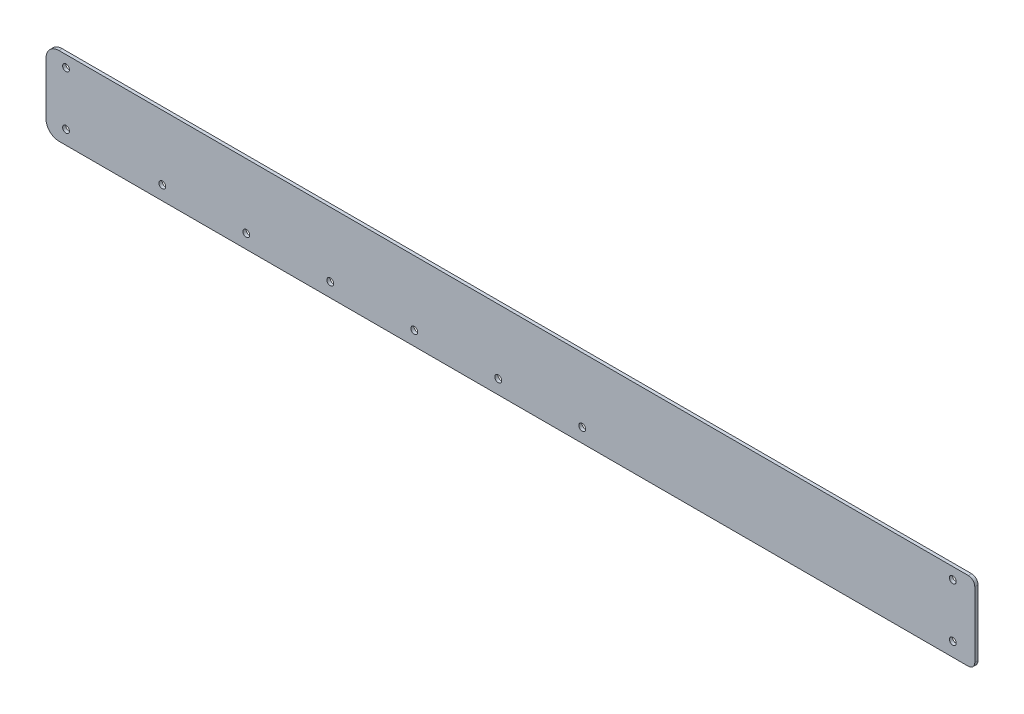
ISO-10303-21;
HEADER;
FILE_DESCRIPTION(('STEP AP214'),'2;1');
FILE_NAME('part.step','',(''),(''),'','','');
FILE_SCHEMA(('AUTOMOTIVE_DESIGN { 1 0 10303 214 1 1 1 1 }'));
ENDSEC;
DATA;
#1=APPLICATION_CONTEXT('core data for automotive mechanical design processes');
#2=APPLICATION_PROTOCOL_DEFINITION('international standard','automotive_design',2000,#1);
#3=PRODUCT_CONTEXT('',#1,'mechanical');
#4=PRODUCT('Part','Part','',(#3));
#5=PRODUCT_RELATED_PRODUCT_CATEGORY('part','',(#4));
#6=PRODUCT_DEFINITION_FORMATION('','',#4);
#7=PRODUCT_DEFINITION_CONTEXT('part definition',#1,'design');
#8=PRODUCT_DEFINITION('design','',#6,#7);
#9=PRODUCT_DEFINITION_SHAPE('','',#8);
#10=(LENGTH_UNIT() NAMED_UNIT(*) SI_UNIT(.MILLI.,.METRE.));
#11=(NAMED_UNIT(*) PLANE_ANGLE_UNIT() SI_UNIT($,.RADIAN.));
#12=(NAMED_UNIT(*) SI_UNIT($,.STERADIAN.) SOLID_ANGLE_UNIT());
#13=UNCERTAINTY_MEASURE_WITH_UNIT(LENGTH_MEASURE(1.E-05),#10,'distance_accuracy_value','');
#14=(GEOMETRIC_REPRESENTATION_CONTEXT(3) GLOBAL_UNCERTAINTY_ASSIGNED_CONTEXT((#13)) GLOBAL_UNIT_ASSIGNED_CONTEXT((#10,
#11,#12)) REPRESENTATION_CONTEXT('',''));
#15=CARTESIAN_POINT('',(0.,0.,0.));
#16=DIRECTION('',(0.,0.,1.));
#17=DIRECTION('',(1.,0.,0.));
#18=AXIS2_PLACEMENT_3D('',#15,#16,#17);
#19=CARTESIAN_POINT('',(370.889379555431,207.968513878229,2.));
#20=DIRECTION('',(0.,0.,1.));
#21=DIRECTION('',(1.,0.,0.));
#22=AXIS2_PLACEMENT_3D('',#19,#20,#21);
#23=PLANE('',#22);
#24=CARTESIAN_POINT('',(361.28937955542,171.922740720662,2.));
#25=DIRECTION('',(0.,0.,1.));
#26=DIRECTION('',(1.,0.,0.));
#27=AXIS2_PLACEMENT_3D('',#24,#25,#26);
#28=CIRCLE('',#27,2.09999999999999);
#29=CARTESIAN_POINT('',(363.38937955542,171.922740720662,2.));
#30=VERTEX_POINT('',#29);
#31=EDGE_CURVE('E224',#30,#30,#28,.T.);
#32=ORIENTED_EDGE('',*,*,#31,.F.);
#33=EDGE_LOOP('',(#32));
#34=FACE_BOUND('',#33,.T.);
#35=CARTESIAN_POINT('',(79.8631122909393,171.922740720662,2.));
#36=DIRECTION('',(0.,0.,1.));
#37=DIRECTION('',(1.,0.,0.));
#38=AXIS2_PLACEMENT_3D('',#35,#36,#37);
#39=CIRCLE('',#38,2.1);
#40=CARTESIAN_POINT('',(81.9631122909393,171.922740720662,2.));
#41=VERTEX_POINT('',#40);
#42=EDGE_CURVE('E212',#41,#41,#39,.T.);
#43=ORIENTED_EDGE('',*,*,#42,.F.);
#44=EDGE_LOOP('',(#43));
#45=FACE_BOUND('',#44,.T.);
#46=CARTESIAN_POINT('',(-128.136887709061,171.922740720662,2.));
#47=DIRECTION('',(0.,0.,1.));
#48=DIRECTION('',(1.,0.,0.));
#49=AXIS2_PLACEMENT_3D('',#46,#47,#48);
#50=CIRCLE('',#49,2.09999999999999);
#51=CARTESIAN_POINT('',(-126.036887709061,171.922740720662,2.));
#52=VERTEX_POINT('',#51);
#53=EDGE_CURVE('E200',#52,#52,#50,.T.);
#54=ORIENTED_EDGE('',*,*,#53,.F.);
#55=EDGE_LOOP('',(#54));
#56=FACE_BOUND('',#55,.T.);
#57=CARTESIAN_POINT('',(-76.1368877090607,171.922740720662,2.));
#58=DIRECTION('',(0.,0.,1.));
#59=DIRECTION('',(1.,0.,0.));
#60=AXIS2_PLACEMENT_3D('',#57,#58,#59);
#61=CIRCLE('',#60,2.1);
#62=CARTESIAN_POINT('',(-74.0368877090607,171.922740720662,2.));
#63=VERTEX_POINT('',#62);
#64=EDGE_CURVE('E188',#63,#63,#61,.T.);
#65=ORIENTED_EDGE('',*,*,#64,.F.);
#66=EDGE_LOOP('',(#65));
#67=FACE_BOUND('',#66,.T.);
#68=CARTESIAN_POINT('',(361.28937955542,204.922740720662,2.));
#69=DIRECTION('',(0.,0.,1.));
#70=DIRECTION('',(1.,0.,0.));
#71=AXIS2_PLACEMENT_3D('',#68,#69,#70);
#72=CIRCLE('',#71,2.09999999999999);
#73=CARTESIAN_POINT('',(363.38937955542,204.922740720662,2.));
#74=VERTEX_POINT('',#73);
#75=EDGE_CURVE('E134',#74,#74,#72,.T.);
#76=ORIENTED_EDGE('',*,*,#75,.F.);
#77=EDGE_LOOP('',(#76));
#78=FACE_BOUND('',#77,.T.);
#79=CARTESIAN_POINT('',(370.889379555431,207.968513878229,2.));
#80=DIRECTION('',(0.,0.,1.));
#81=DIRECTION('',(1.,0.,0.));
#82=AXIS2_PLACEMENT_3D('',#79,#80,#81);
#83=CIRCLE('',#82,4.);
#84=CARTESIAN_POINT('',(374.889379555431,207.968513878229,2.));
#85=VERTEX_POINT('',#84);
#86=CARTESIAN_POINT('',(370.889379555431,211.968513878229,2.));
#87=VERTEX_POINT('',#86);
#88=EDGE_CURVE('E145',#85,#87,#83,.T.);
#89=ORIENTED_EDGE('',*,*,#88,.T.);
#90=DIRECTION('',(-1.,0.,0.));
#91=VECTOR('',#90,1.);
#92=CARTESIAN_POINT('',(370.889379555431,211.968513878229,2.));
#93=LINE('',#92,#91);
#94=CARTESIAN_POINT('',(-192.127528461996,211.968513878229,2.));
#95=VERTEX_POINT('',#94);
#96=EDGE_CURVE('E93',#87,#95,#93,.T.);
#97=ORIENTED_EDGE('',*,*,#96,.T.);
#98=CARTESIAN_POINT('',(-192.127528461996,203.968513878229,2.));
#99=DIRECTION('',(0.,0.,1.));
#100=DIRECTION('',(1.,0.,0.));
#101=AXIS2_PLACEMENT_3D('',#98,#99,#100);
#102=CIRCLE('',#101,8.00000000000002);
#103=CARTESIAN_POINT('',(-200.127528461996,203.968513878229,2.));
#104=VERTEX_POINT('',#103);
#105=EDGE_CURVE('E160',#95,#104,#102,.T.);
#106=ORIENTED_EDGE('',*,*,#105,.T.);
#107=DIRECTION('',(0.,-1.,0.));
#108=VECTOR('',#107,1.);
#109=CARTESIAN_POINT('',(-200.127528461996,171.305548091745,2.));
#110=LINE('',#109,#108);
#111=CARTESIAN_POINT('',(-200.127528461996,171.305548091745,2.));
#112=VERTEX_POINT('',#111);
#113=EDGE_CURVE('E173',#104,#112,#110,.T.);
#114=ORIENTED_EDGE('',*,*,#113,.T.);
#115=CARTESIAN_POINT('',(-192.127528461996,171.305548091745,2.));
#116=DIRECTION('',(0.,0.,1.));
#117=DIRECTION('',(1.,0.,0.));
#118=AXIS2_PLACEMENT_3D('',#115,#116,#117);
#119=CIRCLE('',#118,8.00000000000001);
#120=CARTESIAN_POINT('',(-192.127528461996,163.305548091745,2.));
#121=VERTEX_POINT('',#120);
#122=EDGE_CURVE('E112',#112,#121,#119,.T.);
#123=ORIENTED_EDGE('',*,*,#122,.T.);
#124=DIRECTION('',(1.,0.,0.));
#125=VECTOR('',#124,1.);
#126=CARTESIAN_POINT('',(-192.127528461996,163.305548091745,2.));
#127=LINE('',#126,#125);
#128=CARTESIAN_POINT('',(370.889379555431,163.305548091745,2.));
#129=VERTEX_POINT('',#128);
#130=EDGE_CURVE('E106',#121,#129,#127,.T.);
#131=ORIENTED_EDGE('',*,*,#130,.T.);
#132=CARTESIAN_POINT('',(370.889379555431,167.305548091745,2.));
#133=DIRECTION('',(0.,0.,1.));
#134=DIRECTION('',(1.,0.,0.));
#135=AXIS2_PLACEMENT_3D('',#132,#133,#134);
#136=CIRCLE('',#135,4.);
#137=CARTESIAN_POINT('',(374.889379555431,167.305548091745,2.));
#138=VERTEX_POINT('',#137);
#139=EDGE_CURVE('E110',#129,#138,#136,.T.);
#140=ORIENTED_EDGE('',*,*,#139,.T.);
#141=DIRECTION('',(0.,1.,0.));
#142=VECTOR('',#141,1.);
#143=CARTESIAN_POINT('',(374.889379555431,207.968513878229,2.));
#144=LINE('',#143,#142);
#145=EDGE_CURVE('E50',#138,#85,#144,.T.);
#146=ORIENTED_EDGE('',*,*,#145,.T.);
#147=EDGE_LOOP('',(#89,#97,#106,#114,#123,#131,#140,#146));
#148=FACE_BOUND('',#147,.T.);
#149=CARTESIAN_POINT('',(-187.724187676641,204.922740720662,2.));
#150=DIRECTION('',(0.,0.,1.));
#151=DIRECTION('',(1.,0.,0.));
#152=AXIS2_PLACEMENT_3D('',#149,#150,#151);
#153=CIRCLE('',#152,2.09999999999999);
#154=CARTESIAN_POINT('',(-185.624187676641,204.922740720662,2.));
#155=VERTEX_POINT('',#154);
#156=EDGE_CURVE('E182',#155,#155,#153,.T.);
#157=ORIENTED_EDGE('',*,*,#156,.F.);
#158=EDGE_LOOP('',(#157));
#159=FACE_BOUND('',#158,.T.);
#160=CARTESIAN_POINT('',(-24.1368877090607,171.922740720662,2.));
#161=DIRECTION('',(0.,0.,1.));
#162=DIRECTION('',(1.,0.,0.));
#163=AXIS2_PLACEMENT_3D('',#160,#161,#162);
#164=CIRCLE('',#163,2.1);
#165=CARTESIAN_POINT('',(-22.0368877090607,171.922740720662,2.));
#166=VERTEX_POINT('',#165);
#167=EDGE_CURVE('E194',#166,#166,#164,.T.);
#168=ORIENTED_EDGE('',*,*,#167,.F.);
#169=EDGE_LOOP('',(#168));
#170=FACE_BOUND('',#169,.T.);
#171=CARTESIAN_POINT('',(131.863112290939,171.922740720662,2.));
#172=DIRECTION('',(0.,0.,1.));
#173=DIRECTION('',(1.,0.,0.));
#174=AXIS2_PLACEMENT_3D('',#171,#172,#173);
#175=CIRCLE('',#174,2.09999999999999);
#176=CARTESIAN_POINT('',(133.963112290939,171.922740720662,2.));
#177=VERTEX_POINT('',#176);
#178=EDGE_CURVE('E206',#177,#177,#175,.T.);
#179=ORIENTED_EDGE('',*,*,#178,.F.);
#180=EDGE_LOOP('',(#179));
#181=FACE_BOUND('',#180,.T.);
#182=CARTESIAN_POINT('',(27.8631122909393,171.922740720662,2.));
#183=DIRECTION('',(0.,0.,1.));
#184=DIRECTION('',(1.,0.,0.));
#185=AXIS2_PLACEMENT_3D('',#182,#183,#184);
#186=CIRCLE('',#185,2.1);
#187=CARTESIAN_POINT('',(29.9631122909393,171.922740720662,2.));
#188=VERTEX_POINT('',#187);
#189=EDGE_CURVE('E218',#188,#188,#186,.T.);
#190=ORIENTED_EDGE('',*,*,#189,.F.);
#191=EDGE_LOOP('',(#190));
#192=FACE_BOUND('',#191,.T.);
#193=CARTESIAN_POINT('',(-187.724187676641,171.922740720662,2.));
#194=DIRECTION('',(0.,0.,1.));
#195=DIRECTION('',(1.,0.,0.));
#196=AXIS2_PLACEMENT_3D('',#193,#194,#195);
#197=CIRCLE('',#196,2.09999999999999);
#198=CARTESIAN_POINT('',(-185.624187676641,171.922740720662,2.));
#199=VERTEX_POINT('',#198);
#200=EDGE_CURVE('E230',#199,#199,#197,.T.);
#201=ORIENTED_EDGE('',*,*,#200,.F.);
#202=EDGE_LOOP('',(#201));
#203=FACE_BOUND('',#202,.T.);
#204=ADVANCED_FACE('F33',(#34,#45,#56,#67,#78,#148,#159,#170,#181,#192,#203),#23,.T.);
#205=CARTESIAN_POINT('',(370.889379555431,207.968513878229,0.));
#206=DIRECTION('',(0.,0.,1.));
#207=DIRECTION('',(1.,0.,0.));
#208=AXIS2_PLACEMENT_3D('',#205,#206,#207);
#209=PLANE('',#208);
#210=CARTESIAN_POINT('',(370.889379555431,207.968513878229,0.));
#211=DIRECTION('',(0.,0.,1.));
#212=DIRECTION('',(1.,0.,0.));
#213=AXIS2_PLACEMENT_3D('',#210,#211,#212);
#214=CIRCLE('',#213,4.);
#215=CARTESIAN_POINT('',(374.889379555431,207.968513878229,0.));
#216=VERTEX_POINT('',#215);
#217=CARTESIAN_POINT('',(370.889379555431,211.968513878229,0.));
#218=VERTEX_POINT('',#217);
#219=EDGE_CURVE('E130',#216,#218,#214,.T.);
#220=ORIENTED_EDGE('',*,*,#219,.F.);
#221=DIRECTION('',(0.,1.,0.));
#222=VECTOR('',#221,1.);
#223=CARTESIAN_POINT('',(374.889379555431,207.968513878229,0.));
#224=LINE('',#223,#222);
#225=CARTESIAN_POINT('',(374.889379555431,167.305548091745,0.));
#226=VERTEX_POINT('',#225);
#227=EDGE_CURVE('E85',#226,#216,#224,.T.);
#228=ORIENTED_EDGE('',*,*,#227,.F.);
#229=CARTESIAN_POINT('',(370.889379555431,167.305548091745,0.));
#230=DIRECTION('',(0.,0.,1.));
#231=DIRECTION('',(1.,0.,0.));
#232=AXIS2_PLACEMENT_3D('',#229,#230,#231);
#233=CIRCLE('',#232,4.);
#234=CARTESIAN_POINT('',(370.889379555431,163.305548091745,0.));
#235=VERTEX_POINT('',#234);
#236=EDGE_CURVE('E79',#235,#226,#233,.T.);
#237=ORIENTED_EDGE('',*,*,#236,.F.);
#238=DIRECTION('',(1.,0.,0.));
#239=VECTOR('',#238,1.);
#240=CARTESIAN_POINT('',(-192.127528461996,163.305548091745,0.));
#241=LINE('',#240,#239);
#242=CARTESIAN_POINT('',(-192.127528461996,163.305548091745,0.));
#243=VERTEX_POINT('',#242);
#244=EDGE_CURVE('E120',#243,#235,#241,.T.);
#245=ORIENTED_EDGE('',*,*,#244,.F.);
#246=CARTESIAN_POINT('',(-192.127528461996,171.305548091745,0.));
#247=DIRECTION('',(0.,0.,1.));
#248=DIRECTION('',(1.,0.,0.));
#249=AXIS2_PLACEMENT_3D('',#246,#247,#248);
#250=CIRCLE('',#249,8.00000000000001);
#251=CARTESIAN_POINT('',(-200.127528461996,171.305548091745,0.));
#252=VERTEX_POINT('',#251);
#253=EDGE_CURVE('E140',#252,#243,#250,.T.);
#254=ORIENTED_EDGE('',*,*,#253,.F.);
#255=DIRECTION('',(0.,-1.,0.));
#256=VECTOR('',#255,1.);
#257=CARTESIAN_POINT('',(-200.127528461996,171.305548091745,0.));
#258=LINE('',#257,#256);
#259=CARTESIAN_POINT('',(-200.127528461996,203.968513878229,0.));
#260=VERTEX_POINT('',#259);
#261=EDGE_CURVE('E138',#260,#252,#258,.T.);
#262=ORIENTED_EDGE('',*,*,#261,.F.);
#263=CARTESIAN_POINT('',(-192.127528461996,203.968513878229,0.));
#264=DIRECTION('',(0.,0.,1.));
#265=DIRECTION('',(1.,0.,0.));
#266=AXIS2_PLACEMENT_3D('',#263,#264,#265);
#267=CIRCLE('',#266,8.00000000000002);
#268=CARTESIAN_POINT('',(-192.127528461996,211.968513878229,0.));
#269=VERTEX_POINT('',#268);
#270=EDGE_CURVE('E136',#269,#260,#267,.T.);
#271=ORIENTED_EDGE('',*,*,#270,.F.);
#272=DIRECTION('',(-1.,0.,0.));
#273=VECTOR('',#272,1.);
#274=CARTESIAN_POINT('',(370.889379555431,211.968513878229,0.));
#275=LINE('',#274,#273);
#276=EDGE_CURVE('E133',#218,#269,#275,.T.);
#277=ORIENTED_EDGE('',*,*,#276,.F.);
#278=EDGE_LOOP('',(#220,#228,#237,#245,#254,#262,#271,#277));
#279=FACE_BOUND('',#278,.T.);
#280=CARTESIAN_POINT('',(361.28937955542,204.922740720662,0.));
#281=DIRECTION('',(0.,0.,1.));
#282=DIRECTION('',(1.,0.,0.));
#283=AXIS2_PLACEMENT_3D('',#280,#281,#282);
#284=CIRCLE('',#283,2.09999999999999);
#285=CARTESIAN_POINT('',(363.38937955542,204.922740720662,0.));
#286=VERTEX_POINT('',#285);
#287=EDGE_CURVE('E179',#286,#286,#284,.T.);
#288=ORIENTED_EDGE('',*,*,#287,.T.);
#289=EDGE_LOOP('',(#288));
#290=FACE_BOUND('',#289,.T.);
#291=CARTESIAN_POINT('',(-187.724187676641,204.922740720662,0.));
#292=DIRECTION('',(0.,0.,1.));
#293=DIRECTION('',(1.,0.,0.));
#294=AXIS2_PLACEMENT_3D('',#291,#292,#293);
#295=CIRCLE('',#294,2.09999999999999);
#296=CARTESIAN_POINT('',(-185.624187676641,204.922740720662,0.));
#297=VERTEX_POINT('',#296);
#298=EDGE_CURVE('E185',#297,#297,#295,.T.);
#299=ORIENTED_EDGE('',*,*,#298,.T.);
#300=EDGE_LOOP('',(#299));
#301=FACE_BOUND('',#300,.T.);
#302=CARTESIAN_POINT('',(-76.1368877090607,171.922740720662,0.));
#303=DIRECTION('',(0.,0.,1.));
#304=DIRECTION('',(1.,0.,0.));
#305=AXIS2_PLACEMENT_3D('',#302,#303,#304);
#306=CIRCLE('',#305,2.1);
#307=CARTESIAN_POINT('',(-74.0368877090607,171.922740720662,0.));
#308=VERTEX_POINT('',#307);
#309=EDGE_CURVE('E191',#308,#308,#306,.T.);
#310=ORIENTED_EDGE('',*,*,#309,.T.);
#311=EDGE_LOOP('',(#310));
#312=FACE_BOUND('',#311,.T.);
#313=CARTESIAN_POINT('',(-24.1368877090607,171.922740720662,0.));
#314=DIRECTION('',(0.,0.,1.));
#315=DIRECTION('',(1.,0.,0.));
#316=AXIS2_PLACEMENT_3D('',#313,#314,#315);
#317=CIRCLE('',#316,2.1);
#318=CARTESIAN_POINT('',(-22.0368877090607,171.922740720662,0.));
#319=VERTEX_POINT('',#318);
#320=EDGE_CURVE('E197',#319,#319,#317,.T.);
#321=ORIENTED_EDGE('',*,*,#320,.T.);
#322=EDGE_LOOP('',(#321));
#323=FACE_BOUND('',#322,.T.);
#324=CARTESIAN_POINT('',(-128.136887709061,171.922740720662,0.));
#325=DIRECTION('',(0.,0.,1.));
#326=DIRECTION('',(1.,0.,0.));
#327=AXIS2_PLACEMENT_3D('',#324,#325,#326);
#328=CIRCLE('',#327,2.09999999999999);
#329=CARTESIAN_POINT('',(-126.036887709061,171.922740720662,0.));
#330=VERTEX_POINT('',#329);
#331=EDGE_CURVE('E203',#330,#330,#328,.T.);
#332=ORIENTED_EDGE('',*,*,#331,.T.);
#333=EDGE_LOOP('',(#332));
#334=FACE_BOUND('',#333,.T.);
#335=CARTESIAN_POINT('',(131.863112290939,171.922740720662,0.));
#336=DIRECTION('',(0.,0.,1.));
#337=DIRECTION('',(1.,0.,0.));
#338=AXIS2_PLACEMENT_3D('',#335,#336,#337);
#339=CIRCLE('',#338,2.09999999999999);
#340=CARTESIAN_POINT('',(133.963112290939,171.922740720662,0.));
#341=VERTEX_POINT('',#340);
#342=EDGE_CURVE('E209',#341,#341,#339,.T.);
#343=ORIENTED_EDGE('',*,*,#342,.T.);
#344=EDGE_LOOP('',(#343));
#345=FACE_BOUND('',#344,.T.);
#346=CARTESIAN_POINT('',(79.8631122909393,171.922740720662,0.));
#347=DIRECTION('',(0.,0.,1.));
#348=DIRECTION('',(1.,0.,0.));
#349=AXIS2_PLACEMENT_3D('',#346,#347,#348);
#350=CIRCLE('',#349,2.1);
#351=CARTESIAN_POINT('',(81.9631122909393,171.922740720662,0.));
#352=VERTEX_POINT('',#351);
#353=EDGE_CURVE('E215',#352,#352,#350,.T.);
#354=ORIENTED_EDGE('',*,*,#353,.T.);
#355=EDGE_LOOP('',(#354));
#356=FACE_BOUND('',#355,.T.);
#357=CARTESIAN_POINT('',(27.8631122909393,171.922740720662,0.));
#358=DIRECTION('',(0.,0.,1.));
#359=DIRECTION('',(1.,0.,0.));
#360=AXIS2_PLACEMENT_3D('',#357,#358,#359);
#361=CIRCLE('',#360,2.1);
#362=CARTESIAN_POINT('',(29.9631122909393,171.922740720662,0.));
#363=VERTEX_POINT('',#362);
#364=EDGE_CURVE('E221',#363,#363,#361,.T.);
#365=ORIENTED_EDGE('',*,*,#364,.T.);
#366=EDGE_LOOP('',(#365));
#367=FACE_BOUND('',#366,.T.);
#368=CARTESIAN_POINT('',(361.28937955542,171.922740720662,0.));
#369=DIRECTION('',(0.,0.,1.));
#370=DIRECTION('',(1.,0.,0.));
#371=AXIS2_PLACEMENT_3D('',#368,#369,#370);
#372=CIRCLE('',#371,2.09999999999999);
#373=CARTESIAN_POINT('',(363.38937955542,171.922740720662,0.));
#374=VERTEX_POINT('',#373);
#375=EDGE_CURVE('E227',#374,#374,#372,.T.);
#376=ORIENTED_EDGE('',*,*,#375,.T.);
#377=EDGE_LOOP('',(#376));
#378=FACE_BOUND('',#377,.T.);
#379=CARTESIAN_POINT('',(-187.724187676641,171.922740720662,0.));
#380=DIRECTION('',(0.,0.,1.));
#381=DIRECTION('',(1.,0.,0.));
#382=AXIS2_PLACEMENT_3D('',#379,#380,#381);
#383=CIRCLE('',#382,2.09999999999999);
#384=CARTESIAN_POINT('',(-185.624187676641,171.922740720662,0.));
#385=VERTEX_POINT('',#384);
#386=EDGE_CURVE('E233',#385,#385,#383,.T.);
#387=ORIENTED_EDGE('',*,*,#386,.T.);
#388=EDGE_LOOP('',(#387));
#389=FACE_BOUND('',#388,.T.);
#390=ADVANCED_FACE('F164',(#279,#290,#301,#312,#323,#334,#345,#356,#367,#378,#389),#209,.F.);
#391=CARTESIAN_POINT('',(370.889379555431,207.968513878229,2.));
#392=DIRECTION('',(0.,0.,-1.));
#393=DIRECTION('',(-1.,0.,0.));
#394=AXIS2_PLACEMENT_3D('',#391,#392,#393);
#395=CYLINDRICAL_SURFACE('',#394,4.);
#396=ORIENTED_EDGE('',*,*,#219,.T.);
#397=DIRECTION('',(0.,0.,-1.));
#398=VECTOR('',#397,1.);
#399=CARTESIAN_POINT('',(370.889379555431,211.968513878229,2.));
#400=LINE('',#399,#398);
#401=EDGE_CURVE('E11',#87,#218,#400,.T.);
#402=ORIENTED_EDGE('',*,*,#401,.F.);
#403=ORIENTED_EDGE('',*,*,#88,.F.);
#404=DIRECTION('',(0.,0.,-1.));
#405=VECTOR('',#404,1.);
#406=CARTESIAN_POINT('',(374.889379555431,207.968513878229,2.));
#407=LINE('',#406,#405);
#408=EDGE_CURVE('E126',#85,#216,#407,.T.);
#409=ORIENTED_EDGE('',*,*,#408,.T.);
#410=EDGE_LOOP('',(#396,#402,#403,#409));
#411=FACE_BOUND('',#410,.T.);
#412=ADVANCED_FACE('F35',(#411),#395,.T.);
#413=CARTESIAN_POINT('',(370.889379555431,211.968513878229,2.));
#414=DIRECTION('',(0.,-1.,0.));
#415=DIRECTION('',(1.,0.,0.));
#416=AXIS2_PLACEMENT_3D('',#413,#414,#415);
#417=PLANE('',#416);
#418=ORIENTED_EDGE('',*,*,#276,.T.);
#419=DIRECTION('',(0.,0.,-1.));
#420=VECTOR('',#419,1.);
#421=CARTESIAN_POINT('',(-192.127528461996,211.968513878229,2.));
#422=LINE('',#421,#420);
#423=EDGE_CURVE('E42',#95,#269,#422,.T.);
#424=ORIENTED_EDGE('',*,*,#423,.F.);
#425=ORIENTED_EDGE('',*,*,#96,.F.);
#426=ORIENTED_EDGE('',*,*,#401,.T.);
#427=EDGE_LOOP('',(#418,#424,#425,#426));
#428=FACE_BOUND('',#427,.T.);
#429=ADVANCED_FACE('F267',(#428),#417,.F.);
#430=CARTESIAN_POINT('',(-192.127528461996,203.968513878229,2.));
#431=DIRECTION('',(0.,0.,-1.));
#432=DIRECTION('',(-1.,0.,0.));
#433=AXIS2_PLACEMENT_3D('',#430,#431,#432);
#434=CYLINDRICAL_SURFACE('',#433,8.00000000000002);
#435=ORIENTED_EDGE('',*,*,#270,.T.);
#436=DIRECTION('',(0.,0.,-1.));
#437=VECTOR('',#436,1.);
#438=CARTESIAN_POINT('',(-200.127528461996,203.968513878229,2.));
#439=LINE('',#438,#437);
#440=EDGE_CURVE('E152',#104,#260,#439,.T.);
#441=ORIENTED_EDGE('',*,*,#440,.F.);
#442=ORIENTED_EDGE('',*,*,#105,.F.);
#443=ORIENTED_EDGE('',*,*,#423,.T.);
#444=EDGE_LOOP('',(#435,#441,#442,#443));
#445=FACE_BOUND('',#444,.T.);
#446=ADVANCED_FACE('F158',(#445),#434,.T.);
#447=CARTESIAN_POINT('',(-200.127528461996,171.305548091745,2.));
#448=DIRECTION('',(1.,0.,0.));
#449=DIRECTION('',(0.,0.,-1.));
#450=AXIS2_PLACEMENT_3D('',#447,#448,#449);
#451=PLANE('',#450);
#452=ORIENTED_EDGE('',*,*,#261,.T.);
#453=DIRECTION('',(0.,0.,-1.));
#454=VECTOR('',#453,1.);
#455=CARTESIAN_POINT('',(-200.127528461996,171.305548091745,2.));
#456=LINE('',#455,#454);
#457=EDGE_CURVE('E149',#112,#252,#456,.T.);
#458=ORIENTED_EDGE('',*,*,#457,.F.);
#459=ORIENTED_EDGE('',*,*,#113,.F.);
#460=ORIENTED_EDGE('',*,*,#440,.T.);
#461=EDGE_LOOP('',(#452,#458,#459,#460));
#462=FACE_BOUND('',#461,.T.);
#463=ADVANCED_FACE('F169',(#462),#451,.F.);
#464=CARTESIAN_POINT('',(-192.127528461996,171.305548091745,2.));
#465=DIRECTION('',(0.,0.,-1.));
#466=DIRECTION('',(-1.,0.,0.));
#467=AXIS2_PLACEMENT_3D('',#464,#465,#466);
#468=CYLINDRICAL_SURFACE('',#467,8.00000000000001);
#469=ORIENTED_EDGE('',*,*,#253,.T.);
#470=DIRECTION('',(0.,0.,-1.));
#471=VECTOR('',#470,1.);
#472=CARTESIAN_POINT('',(-192.127528461996,163.305548091745,2.));
#473=LINE('',#472,#471);
#474=EDGE_CURVE('E121',#121,#243,#473,.T.);
#475=ORIENTED_EDGE('',*,*,#474,.F.);
#476=ORIENTED_EDGE('',*,*,#122,.F.);
#477=ORIENTED_EDGE('',*,*,#457,.T.);
#478=EDGE_LOOP('',(#469,#475,#476,#477));
#479=FACE_BOUND('',#478,.T.);
#480=ADVANCED_FACE('F172',(#479),#468,.T.);
#481=CARTESIAN_POINT('',(-192.127528461996,163.305548091745,2.));
#482=DIRECTION('',(0.,1.,0.));
#483=DIRECTION('',(-1.,0.,0.));
#484=AXIS2_PLACEMENT_3D('',#481,#482,#483);
#485=PLANE('',#484);
#486=ORIENTED_EDGE('',*,*,#244,.T.);
#487=DIRECTION('',(0.,0.,-1.));
#488=VECTOR('',#487,1.);
#489=CARTESIAN_POINT('',(370.889379555431,163.305548091745,2.));
#490=LINE('',#489,#488);
#491=EDGE_CURVE('E117',#129,#235,#490,.T.);
#492=ORIENTED_EDGE('',*,*,#491,.F.);
#493=ORIENTED_EDGE('',*,*,#130,.F.);
#494=ORIENTED_EDGE('',*,*,#474,.T.);
#495=EDGE_LOOP('',(#486,#492,#493,#494));
#496=FACE_BOUND('',#495,.T.);
#497=ADVANCED_FACE('F118',(#496),#485,.F.);
#498=CARTESIAN_POINT('',(370.889379555431,167.305548091745,2.));
#499=DIRECTION('',(0.,0.,-1.));
#500=DIRECTION('',(-1.,0.,0.));
#501=AXIS2_PLACEMENT_3D('',#498,#499,#500);
#502=CYLINDRICAL_SURFACE('',#501,4.);
#503=ORIENTED_EDGE('',*,*,#236,.T.);
#504=DIRECTION('',(0.,0.,-1.));
#505=VECTOR('',#504,1.);
#506=CARTESIAN_POINT('',(374.889379555431,167.305548091745,2.));
#507=LINE('',#506,#505);
#508=EDGE_CURVE('E122',#138,#226,#507,.T.);
#509=ORIENTED_EDGE('',*,*,#508,.F.);
#510=ORIENTED_EDGE('',*,*,#139,.F.);
#511=ORIENTED_EDGE('',*,*,#491,.T.);
#512=EDGE_LOOP('',(#503,#509,#510,#511));
#513=FACE_BOUND('',#512,.T.);
#514=ADVANCED_FACE('F124',(#513),#502,.T.);
#515=CARTESIAN_POINT('',(374.889379555431,207.968513878229,2.));
#516=DIRECTION('',(-1.,0.,0.));
#517=DIRECTION('',(0.,0.,1.));
#518=AXIS2_PLACEMENT_3D('',#515,#516,#517);
#519=PLANE('',#518);
#520=ORIENTED_EDGE('',*,*,#227,.T.);
#521=ORIENTED_EDGE('',*,*,#408,.F.);
#522=ORIENTED_EDGE('',*,*,#145,.F.);
#523=ORIENTED_EDGE('',*,*,#508,.T.);
#524=EDGE_LOOP('',(#520,#521,#522,#523));
#525=FACE_BOUND('',#524,.T.);
#526=ADVANCED_FACE('F255',(#525),#519,.F.);
#527=CARTESIAN_POINT('',(361.28937955542,204.922740720662,2.));
#528=DIRECTION('',(0.,0.,-1.));
#529=DIRECTION('',(-1.,0.,0.));
#530=AXIS2_PLACEMENT_3D('',#527,#528,#529);
#531=CYLINDRICAL_SURFACE('',#530,2.09999999999999);
#532=ORIENTED_EDGE('',*,*,#75,.T.);
#533=EDGE_LOOP('',(#532));
#534=FACE_BOUND('',#533,.T.);
#535=ORIENTED_EDGE('',*,*,#287,.F.);
#536=EDGE_LOOP('',(#535));
#537=FACE_BOUND('',#536,.T.);
#538=ADVANCED_FACE('F252',(#534,#537),#531,.F.);
#539=CARTESIAN_POINT('',(-187.724187676641,204.922740720662,2.));
#540=DIRECTION('',(0.,0.,-1.));
#541=DIRECTION('',(-1.,0.,0.));
#542=AXIS2_PLACEMENT_3D('',#539,#540,#541);
#543=CYLINDRICAL_SURFACE('',#542,2.09999999999999);
#544=ORIENTED_EDGE('',*,*,#156,.T.);
#545=EDGE_LOOP('',(#544));
#546=FACE_BOUND('',#545,.T.);
#547=ORIENTED_EDGE('',*,*,#298,.F.);
#548=EDGE_LOOP('',(#547));
#549=FACE_BOUND('',#548,.T.);
#550=ADVANCED_FACE('F331',(#546,#549),#543,.F.);
#551=CARTESIAN_POINT('',(-76.1368877090607,171.922740720662,2.));
#552=DIRECTION('',(0.,0.,-1.));
#553=DIRECTION('',(-1.,0.,0.));
#554=AXIS2_PLACEMENT_3D('',#551,#552,#553);
#555=CYLINDRICAL_SURFACE('',#554,2.1);
#556=ORIENTED_EDGE('',*,*,#64,.T.);
#557=EDGE_LOOP('',(#556));
#558=FACE_BOUND('',#557,.T.);
#559=ORIENTED_EDGE('',*,*,#309,.F.);
#560=EDGE_LOOP('',(#559));
#561=FACE_BOUND('',#560,.T.);
#562=ADVANCED_FACE('F339',(#558,#561),#555,.F.);
#563=CARTESIAN_POINT('',(-24.1368877090607,171.922740720662,2.));
#564=DIRECTION('',(0.,0.,-1.));
#565=DIRECTION('',(-1.,0.,0.));
#566=AXIS2_PLACEMENT_3D('',#563,#564,#565);
#567=CYLINDRICAL_SURFACE('',#566,2.1);
#568=ORIENTED_EDGE('',*,*,#167,.T.);
#569=EDGE_LOOP('',(#568));
#570=FACE_BOUND('',#569,.T.);
#571=ORIENTED_EDGE('',*,*,#320,.F.);
#572=EDGE_LOOP('',(#571));
#573=FACE_BOUND('',#572,.T.);
#574=ADVANCED_FACE('F347',(#570,#573),#567,.F.);
#575=CARTESIAN_POINT('',(-128.136887709061,171.922740720662,2.));
#576=DIRECTION('',(0.,0.,-1.));
#577=DIRECTION('',(-1.,0.,0.));
#578=AXIS2_PLACEMENT_3D('',#575,#576,#577);
#579=CYLINDRICAL_SURFACE('',#578,2.09999999999999);
#580=ORIENTED_EDGE('',*,*,#53,.T.);
#581=EDGE_LOOP('',(#580));
#582=FACE_BOUND('',#581,.T.);
#583=ORIENTED_EDGE('',*,*,#331,.F.);
#584=EDGE_LOOP('',(#583));
#585=FACE_BOUND('',#584,.T.);
#586=ADVANCED_FACE('F356',(#582,#585),#579,.F.);
#587=CARTESIAN_POINT('',(131.863112290939,171.922740720662,2.));
#588=DIRECTION('',(0.,0.,-1.));
#589=DIRECTION('',(-1.,0.,0.));
#590=AXIS2_PLACEMENT_3D('',#587,#588,#589);
#591=CYLINDRICAL_SURFACE('',#590,2.09999999999999);
#592=ORIENTED_EDGE('',*,*,#178,.T.);
#593=EDGE_LOOP('',(#592));
#594=FACE_BOUND('',#593,.T.);
#595=ORIENTED_EDGE('',*,*,#342,.F.);
#596=EDGE_LOOP('',(#595));
#597=FACE_BOUND('',#596,.T.);
#598=ADVANCED_FACE('F365',(#594,#597),#591,.F.);
#599=CARTESIAN_POINT('',(79.8631122909393,171.922740720662,2.));
#600=DIRECTION('',(0.,0.,-1.));
#601=DIRECTION('',(-1.,0.,0.));
#602=AXIS2_PLACEMENT_3D('',#599,#600,#601);
#603=CYLINDRICAL_SURFACE('',#602,2.1);
#604=ORIENTED_EDGE('',*,*,#42,.T.);
#605=EDGE_LOOP('',(#604));
#606=FACE_BOUND('',#605,.T.);
#607=ORIENTED_EDGE('',*,*,#353,.F.);
#608=EDGE_LOOP('',(#607));
#609=FACE_BOUND('',#608,.T.);
#610=ADVANCED_FACE('F374',(#606,#609),#603,.F.);
#611=CARTESIAN_POINT('',(27.8631122909393,171.922740720662,2.));
#612=DIRECTION('',(0.,0.,-1.));
#613=DIRECTION('',(-1.,0.,0.));
#614=AXIS2_PLACEMENT_3D('',#611,#612,#613);
#615=CYLINDRICAL_SURFACE('',#614,2.1);
#616=ORIENTED_EDGE('',*,*,#189,.T.);
#617=EDGE_LOOP('',(#616));
#618=FACE_BOUND('',#617,.T.);
#619=ORIENTED_EDGE('',*,*,#364,.F.);
#620=EDGE_LOOP('',(#619));
#621=FACE_BOUND('',#620,.T.);
#622=ADVANCED_FACE('F383',(#618,#621),#615,.F.);
#623=CARTESIAN_POINT('',(361.28937955542,171.922740720662,2.));
#624=DIRECTION('',(0.,0.,-1.));
#625=DIRECTION('',(-1.,0.,0.));
#626=AXIS2_PLACEMENT_3D('',#623,#624,#625);
#627=CYLINDRICAL_SURFACE('',#626,2.09999999999999);
#628=ORIENTED_EDGE('',*,*,#31,.T.);
#629=EDGE_LOOP('',(#628));
#630=FACE_BOUND('',#629,.T.);
#631=ORIENTED_EDGE('',*,*,#375,.F.);
#632=EDGE_LOOP('',(#631));
#633=FACE_BOUND('',#632,.T.);
#634=ADVANCED_FACE('F392',(#630,#633),#627,.F.);
#635=CARTESIAN_POINT('',(-187.724187676641,171.922740720662,2.));
#636=DIRECTION('',(0.,0.,-1.));
#637=DIRECTION('',(-1.,0.,0.));
#638=AXIS2_PLACEMENT_3D('',#635,#636,#637);
#639=CYLINDRICAL_SURFACE('',#638,2.09999999999999);
#640=ORIENTED_EDGE('',*,*,#200,.T.);
#641=EDGE_LOOP('',(#640));
#642=FACE_BOUND('',#641,.T.);
#643=ORIENTED_EDGE('',*,*,#386,.F.);
#644=EDGE_LOOP('',(#643));
#645=FACE_BOUND('',#644,.T.);
#646=ADVANCED_FACE('F239',(#642,#645),#639,.F.);
#647=CLOSED_SHELL('',(#204,#390,#412,#429,#446,#463,#480,#497,#514,#526,#538,#550,#562,#574,
#586,#598,#610,#622,#634,#646));
#648=MANIFOLD_SOLID_BREP('B2',#647);
#649=ADVANCED_BREP_SHAPE_REPRESENTATION('',(#18,#648),#14);
#650=SHAPE_DEFINITION_REPRESENTATION(#9,#649);
ENDSEC;
END-ISO-10303-21;
